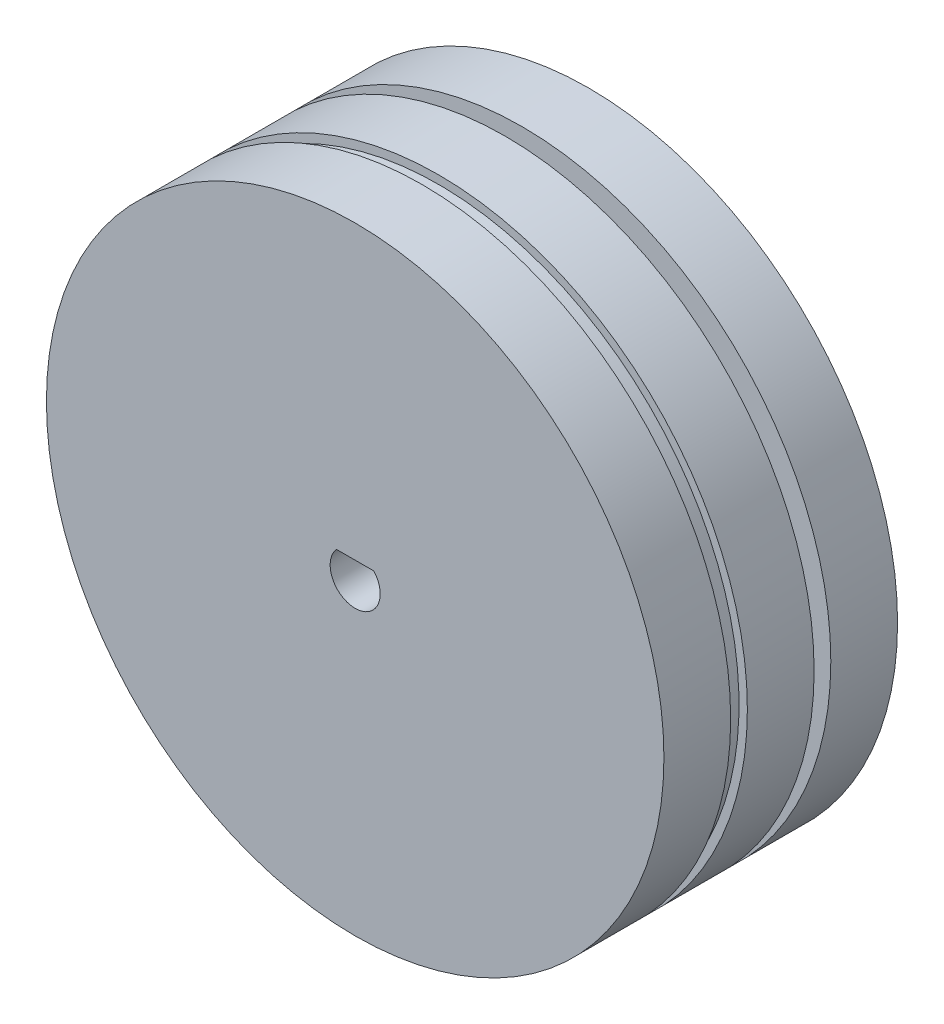
ISO-10303-21;
HEADER;
FILE_DESCRIPTION(('STEP AP214'),'2;1');
FILE_NAME('part.step','',(''),(''),'','','');
FILE_SCHEMA(('AUTOMOTIVE_DESIGN { 1 0 10303 214 1 1 1 1 }'));
ENDSEC;
DATA;
#1=APPLICATION_CONTEXT('core data for automotive mechanical design processes');
#2=APPLICATION_PROTOCOL_DEFINITION('international standard','automotive_design',2000,#1);
#3=PRODUCT_CONTEXT('',#1,'mechanical');
#4=PRODUCT('Part','Part','',(#3));
#5=PRODUCT_RELATED_PRODUCT_CATEGORY('part','',(#4));
#6=PRODUCT_DEFINITION_FORMATION('','',#4);
#7=PRODUCT_DEFINITION_CONTEXT('part definition',#1,'design');
#8=PRODUCT_DEFINITION('design','',#6,#7);
#9=PRODUCT_DEFINITION_SHAPE('','',#8);
#10=(LENGTH_UNIT() NAMED_UNIT(*) SI_UNIT(.MILLI.,.METRE.));
#11=(NAMED_UNIT(*) PLANE_ANGLE_UNIT() SI_UNIT($,.RADIAN.));
#12=(NAMED_UNIT(*) SI_UNIT($,.STERADIAN.) SOLID_ANGLE_UNIT());
#13=UNCERTAINTY_MEASURE_WITH_UNIT(LENGTH_MEASURE(1.E-05),#10,'distance_accuracy_value','');
#14=(GEOMETRIC_REPRESENTATION_CONTEXT(3) GLOBAL_UNCERTAINTY_ASSIGNED_CONTEXT((#13)) GLOBAL_UNIT_ASSIGNED_CONTEXT((#10,
#11,#12)) REPRESENTATION_CONTEXT('',''));
#15=CARTESIAN_POINT('',(0.,0.,0.));
#16=DIRECTION('',(0.,0.,1.));
#17=DIRECTION('',(1.,0.,0.));
#18=AXIS2_PLACEMENT_3D('',#15,#16,#17);
#19=CARTESIAN_POINT('',(0.,0.,4.));
#20=DIRECTION('',(0.,0.,-1.));
#21=DIRECTION('',(-1.,0.,0.));
#22=AXIS2_PLACEMENT_3D('',#19,#20,#21);
#23=CYLINDRICAL_SURFACE('',#22,18.5);
#24=CARTESIAN_POINT('',(0.,0.,4.));
#25=DIRECTION('',(0.,0.,1.));
#26=DIRECTION('',(1.,0.,0.));
#27=AXIS2_PLACEMENT_3D('',#24,#25,#26);
#28=CIRCLE('',#27,18.5);
#29=CARTESIAN_POINT('',(18.5,0.,4.));
#30=VERTEX_POINT('',#29);
#31=EDGE_CURVE('E107',#30,#30,#28,.T.);
#32=ORIENTED_EDGE('',*,*,#31,.F.);
#33=EDGE_LOOP('',(#32));
#34=FACE_BOUND('',#33,.T.);
#35=CARTESIAN_POINT('',(0.,0.,0.));
#36=DIRECTION('',(0.,0.,1.));
#37=DIRECTION('',(1.,0.,0.));
#38=AXIS2_PLACEMENT_3D('',#35,#36,#37);
#39=CIRCLE('',#38,18.5);
#40=CARTESIAN_POINT('',(18.5,0.,0.));
#41=VERTEX_POINT('',#40);
#42=EDGE_CURVE('E40',#41,#41,#39,.T.);
#43=ORIENTED_EDGE('',*,*,#42,.T.);
#44=EDGE_LOOP('',(#43));
#45=FACE_BOUND('',#44,.T.);
#46=ADVANCED_FACE('F37',(#34,#45),#23,.T.);
#47=CARTESIAN_POINT('',(0.,0.,4.));
#48=DIRECTION('',(0.,0.,1.));
#49=DIRECTION('',(1.,0.,0.));
#50=AXIS2_PLACEMENT_3D('',#47,#48,#49);
#51=PLANE('',#50);
#52=CARTESIAN_POINT('',(0.,0.,4.));
#53=DIRECTION('',(0.,0.,1.));
#54=DIRECTION('',(1.,0.,0.));
#55=AXIS2_PLACEMENT_3D('',#52,#53,#54);
#56=CIRCLE('',#55,1.5);
#57=CARTESIAN_POINT('',(-1.1180339887499,1.,4.));
#58=VERTEX_POINT('',#57);
#59=CARTESIAN_POINT('',(1.1180339887499,1.,4.));
#60=VERTEX_POINT('',#59);
#61=EDGE_CURVE('E53',#58,#60,#56,.T.);
#62=ORIENTED_EDGE('',*,*,#61,.F.);
#63=DIRECTION('',(-1.,0.,0.));
#64=VECTOR('',#63,1.);
#65=CARTESIAN_POINT('',(1.1180339887499,1.,4.));
#66=LINE('',#65,#64);
#67=EDGE_CURVE('E73',#60,#58,#66,.T.);
#68=ORIENTED_EDGE('',*,*,#67,.F.);
#69=EDGE_LOOP('',(#62,#68));
#70=FACE_BOUND('',#69,.T.);
#71=ORIENTED_EDGE('',*,*,#31,.T.);
#72=EDGE_LOOP('',(#71));
#73=FACE_BOUND('',#72,.T.);
#74=ADVANCED_FACE('F77',(#70,#73),#51,.T.);
#75=CARTESIAN_POINT('',(0.,0.,0.));
#76=DIRECTION('',(0.,0.,1.));
#77=DIRECTION('',(1.,0.,0.));
#78=AXIS2_PLACEMENT_3D('',#75,#76,#77);
#79=PLANE('',#78);
#80=CARTESIAN_POINT('',(0.,0.,0.));
#81=DIRECTION('',(0.,0.,-1.));
#82=DIRECTION('',(-1.,0.,0.));
#83=AXIS2_PLACEMENT_3D('',#80,#81,#82);
#84=CIRCLE('',#83,18.);
#85=CARTESIAN_POINT('',(-18.,0.,0.));
#86=VERTEX_POINT('',#85);
#87=EDGE_CURVE('E45',#86,#86,#84,.T.);
#88=ORIENTED_EDGE('',*,*,#87,.F.);
#89=EDGE_LOOP('',(#88));
#90=FACE_BOUND('',#89,.T.);
#91=ORIENTED_EDGE('',*,*,#42,.F.);
#92=EDGE_LOOP('',(#91));
#93=FACE_BOUND('',#92,.T.);
#94=ADVANCED_FACE('F114',(#90,#93),#79,.F.);
#95=CARTESIAN_POINT('',(0.,0.,-1.));
#96=DIRECTION('',(0.,0.,1.));
#97=DIRECTION('',(1.,0.,0.));
#98=AXIS2_PLACEMENT_3D('',#95,#96,#97);
#99=CYLINDRICAL_SURFACE('',#98,18.);
#100=CARTESIAN_POINT('',(0.,0.,-1.));
#101=DIRECTION('',(0.,0.,-1.));
#102=DIRECTION('',(-1.,0.,0.));
#103=AXIS2_PLACEMENT_3D('',#100,#101,#102);
#104=CIRCLE('',#103,18.);
#105=CARTESIAN_POINT('',(-18.,0.,-1.));
#106=VERTEX_POINT('',#105);
#107=EDGE_CURVE('E101',#106,#106,#104,.T.);
#108=ORIENTED_EDGE('',*,*,#107,.F.);
#109=EDGE_LOOP('',(#108));
#110=FACE_BOUND('',#109,.T.);
#111=ORIENTED_EDGE('',*,*,#87,.T.);
#112=EDGE_LOOP('',(#111));
#113=FACE_BOUND('',#112,.T.);
#114=ADVANCED_FACE('F116',(#110,#113),#99,.T.);
#115=CARTESIAN_POINT('',(0.,0.,-5.));
#116=DIRECTION('',(0.,0.,1.));
#117=DIRECTION('',(1.,0.,0.));
#118=AXIS2_PLACEMENT_3D('',#115,#116,#117);
#119=CYLINDRICAL_SURFACE('',#118,18.5);
#120=CARTESIAN_POINT('',(0.,0.,-5.));
#121=DIRECTION('',(0.,0.,-1.));
#122=DIRECTION('',(-1.,0.,0.));
#123=AXIS2_PLACEMENT_3D('',#120,#121,#122);
#124=CIRCLE('',#123,18.5);
#125=CARTESIAN_POINT('',(-18.5,0.,-5.));
#126=VERTEX_POINT('',#125);
#127=EDGE_CURVE('E98',#126,#126,#124,.T.);
#128=ORIENTED_EDGE('',*,*,#127,.F.);
#129=EDGE_LOOP('',(#128));
#130=FACE_BOUND('',#129,.T.);
#131=CARTESIAN_POINT('',(0.,0.,-1.));
#132=DIRECTION('',(0.,0.,-1.));
#133=DIRECTION('',(-1.,0.,0.));
#134=AXIS2_PLACEMENT_3D('',#131,#132,#133);
#135=CIRCLE('',#134,18.5);
#136=CARTESIAN_POINT('',(-18.5,0.,-1.));
#137=VERTEX_POINT('',#136);
#138=EDGE_CURVE('E96',#137,#137,#135,.T.);
#139=ORIENTED_EDGE('',*,*,#138,.T.);
#140=EDGE_LOOP('',(#139));
#141=FACE_BOUND('',#140,.T.);
#142=ADVANCED_FACE('F122',(#130,#141),#119,.T.);
#143=CARTESIAN_POINT('',(0.,0.,-5.));
#144=DIRECTION('',(0.,0.,-1.));
#145=DIRECTION('',(-1.,0.,0.));
#146=AXIS2_PLACEMENT_3D('',#143,#144,#145);
#147=PLANE('',#146);
#148=CARTESIAN_POINT('',(0.,0.,-5.));
#149=DIRECTION('',(0.,0.,-1.));
#150=DIRECTION('',(-1.,0.,0.));
#151=AXIS2_PLACEMENT_3D('',#148,#149,#150);
#152=CIRCLE('',#151,17.);
#153=CARTESIAN_POINT('',(-17.,0.,-5.));
#154=VERTEX_POINT('',#153);
#155=EDGE_CURVE('E11',#154,#154,#152,.T.);
#156=ORIENTED_EDGE('',*,*,#155,.F.);
#157=EDGE_LOOP('',(#156));
#158=FACE_BOUND('',#157,.T.);
#159=ORIENTED_EDGE('',*,*,#127,.T.);
#160=EDGE_LOOP('',(#159));
#161=FACE_BOUND('',#160,.T.);
#162=ADVANCED_FACE('F215',(#158,#161),#147,.T.);
#163=CARTESIAN_POINT('',(0.,0.,-1.));
#164=DIRECTION('',(0.,0.,-1.));
#165=DIRECTION('',(-1.,0.,0.));
#166=AXIS2_PLACEMENT_3D('',#163,#164,#165);
#167=PLANE('',#166);
#168=ORIENTED_EDGE('',*,*,#107,.T.);
#169=EDGE_LOOP('',(#168));
#170=FACE_BOUND('',#169,.T.);
#171=ORIENTED_EDGE('',*,*,#138,.F.);
#172=EDGE_LOOP('',(#171));
#173=FACE_BOUND('',#172,.T.);
#174=ADVANCED_FACE('F213',(#170,#173),#167,.F.);
#175=CARTESIAN_POINT('',(0.,0.,-6.));
#176=DIRECTION('',(0.,0.,1.));
#177=DIRECTION('',(1.,0.,0.));
#178=AXIS2_PLACEMENT_3D('',#175,#176,#177);
#179=CYLINDRICAL_SURFACE('',#178,17.);
#180=CARTESIAN_POINT('',(0.,0.,-6.));
#181=DIRECTION('',(0.,0.,-1.));
#182=DIRECTION('',(-1.,0.,0.));
#183=AXIS2_PLACEMENT_3D('',#180,#181,#182);
#184=CIRCLE('',#183,17.);
#185=CARTESIAN_POINT('',(-17.,0.,-6.));
#186=VERTEX_POINT('',#185);
#187=EDGE_CURVE('E92',#186,#186,#184,.T.);
#188=ORIENTED_EDGE('',*,*,#187,.F.);
#189=EDGE_LOOP('',(#188));
#190=FACE_BOUND('',#189,.T.);
#191=ORIENTED_EDGE('',*,*,#155,.T.);
#192=EDGE_LOOP('',(#191));
#193=FACE_BOUND('',#192,.T.);
#194=ADVANCED_FACE('F209',(#190,#193),#179,.T.);
#195=CARTESIAN_POINT('',(0.,0.,-10.));
#196=DIRECTION('',(0.,0.,1.));
#197=DIRECTION('',(1.,0.,0.));
#198=AXIS2_PLACEMENT_3D('',#195,#196,#197);
#199=CYLINDRICAL_SURFACE('',#198,18.5);
#200=CARTESIAN_POINT('',(0.,0.,-10.));
#201=DIRECTION('',(0.,0.,-1.));
#202=DIRECTION('',(-1.,0.,0.));
#203=AXIS2_PLACEMENT_3D('',#200,#201,#202);
#204=CIRCLE('',#203,18.5);
#205=CARTESIAN_POINT('',(-18.5,0.,-10.));
#206=VERTEX_POINT('',#205);
#207=EDGE_CURVE('E89',#206,#206,#204,.T.);
#208=ORIENTED_EDGE('',*,*,#207,.F.);
#209=EDGE_LOOP('',(#208));
#210=FACE_BOUND('',#209,.T.);
#211=CARTESIAN_POINT('',(0.,0.,-6.));
#212=DIRECTION('',(0.,0.,-1.));
#213=DIRECTION('',(-1.,0.,0.));
#214=AXIS2_PLACEMENT_3D('',#211,#212,#213);
#215=CIRCLE('',#214,18.5);
#216=CARTESIAN_POINT('',(-18.5,0.,-6.));
#217=VERTEX_POINT('',#216);
#218=EDGE_CURVE('E69',#217,#217,#215,.T.);
#219=ORIENTED_EDGE('',*,*,#218,.T.);
#220=EDGE_LOOP('',(#219));
#221=FACE_BOUND('',#220,.T.);
#222=ADVANCED_FACE('F181',(#210,#221),#199,.T.);
#223=CARTESIAN_POINT('',(0.,0.,-10.));
#224=DIRECTION('',(0.,0.,-1.));
#225=DIRECTION('',(-1.,0.,0.));
#226=AXIS2_PLACEMENT_3D('',#223,#224,#225);
#227=PLANE('',#226);
#228=CARTESIAN_POINT('',(0.,0.,-10.));
#229=DIRECTION('',(0.,0.,-1.));
#230=DIRECTION('',(-1.,0.,0.));
#231=AXIS2_PLACEMENT_3D('',#228,#229,#230);
#232=CIRCLE('',#231,3.);
#233=CARTESIAN_POINT('',(-3.,0.,-10.));
#234=VERTEX_POINT('',#233);
#235=EDGE_CURVE('E82',#234,#234,#232,.T.);
#236=ORIENTED_EDGE('',*,*,#235,.F.);
#237=EDGE_LOOP('',(#236));
#238=FACE_BOUND('',#237,.T.);
#239=ORIENTED_EDGE('',*,*,#207,.T.);
#240=EDGE_LOOP('',(#239));
#241=FACE_BOUND('',#240,.T.);
#242=ADVANCED_FACE('F176',(#238,#241),#227,.T.);
#243=CARTESIAN_POINT('',(0.,0.,-6.));
#244=DIRECTION('',(0.,0.,-1.));
#245=DIRECTION('',(-1.,0.,0.));
#246=AXIS2_PLACEMENT_3D('',#243,#244,#245);
#247=PLANE('',#246);
#248=ORIENTED_EDGE('',*,*,#187,.T.);
#249=EDGE_LOOP('',(#248));
#250=FACE_BOUND('',#249,.T.);
#251=ORIENTED_EDGE('',*,*,#218,.F.);
#252=EDGE_LOOP('',(#251));
#253=FACE_BOUND('',#252,.T.);
#254=ADVANCED_FACE('F142',(#250,#253),#247,.F.);
#255=CARTESIAN_POINT('',(0.,0.,-2.));
#256=DIRECTION('',(0.,0.,1.));
#257=DIRECTION('',(1.,0.,0.));
#258=AXIS2_PLACEMENT_3D('',#255,#256,#257);
#259=CYLINDRICAL_SURFACE('',#258,1.5);
#260=ORIENTED_EDGE('',*,*,#61,.T.);
#261=DIRECTION('',(0.,0.,1.));
#262=VECTOR('',#261,1.);
#263=CARTESIAN_POINT('',(1.1180339887499,1.,-2.));
#264=LINE('',#263,#262);
#265=CARTESIAN_POINT('',(1.1180339887499,1.,-2.));
#266=VERTEX_POINT('',#265);
#267=EDGE_CURVE('E70',#266,#60,#264,.T.);
#268=ORIENTED_EDGE('',*,*,#267,.F.);
#269=CARTESIAN_POINT('',(0.,0.,-2.));
#270=DIRECTION('',(0.,0.,1.));
#271=DIRECTION('',(1.,0.,0.));
#272=AXIS2_PLACEMENT_3D('',#269,#270,#271);
#273=CIRCLE('',#272,1.5);
#274=CARTESIAN_POINT('',(-1.1180339887499,1.,-2.));
#275=VERTEX_POINT('',#274);
#276=EDGE_CURVE('E67',#275,#266,#273,.T.);
#277=ORIENTED_EDGE('',*,*,#276,.F.);
#278=DIRECTION('',(0.,0.,1.));
#279=VECTOR('',#278,1.);
#280=CARTESIAN_POINT('',(-1.1180339887499,1.,-2.));
#281=LINE('',#280,#279);
#282=EDGE_CURVE('E61',#275,#58,#281,.T.);
#283=ORIENTED_EDGE('',*,*,#282,.T.);
#284=EDGE_LOOP('',(#260,#268,#277,#283));
#285=FACE_BOUND('',#284,.T.);
#286=ADVANCED_FACE('F65',(#285),#259,.F.);
#287=CARTESIAN_POINT('',(1.1180339887499,1.,-2.));
#288=DIRECTION('',(0.,1.,0.));
#289=DIRECTION('',(0.,0.,1.));
#290=AXIS2_PLACEMENT_3D('',#287,#288,#289);
#291=PLANE('',#290);
#292=ORIENTED_EDGE('',*,*,#67,.T.);
#293=ORIENTED_EDGE('',*,*,#282,.F.);
#294=DIRECTION('',(-1.,0.,0.));
#295=VECTOR('',#294,1.);
#296=CARTESIAN_POINT('',(1.1180339887499,1.,-2.));
#297=LINE('',#296,#295);
#298=EDGE_CURVE('E85',#266,#275,#297,.T.);
#299=ORIENTED_EDGE('',*,*,#298,.F.);
#300=ORIENTED_EDGE('',*,*,#267,.T.);
#301=EDGE_LOOP('',(#292,#293,#299,#300));
#302=FACE_BOUND('',#301,.T.);
#303=ADVANCED_FACE('F74',(#302),#291,.F.);
#304=CARTESIAN_POINT('',(0.,0.,-2.));
#305=DIRECTION('',(0.,0.,1.));
#306=DIRECTION('',(1.,0.,0.));
#307=AXIS2_PLACEMENT_3D('',#304,#305,#306);
#308=PLANE('',#307);
#309=ORIENTED_EDGE('',*,*,#276,.T.);
#310=ORIENTED_EDGE('',*,*,#298,.T.);
#311=EDGE_LOOP('',(#309,#310));
#312=FACE_BOUND('',#311,.T.);
#313=ADVANCED_FACE('F159',(#312),#308,.T.);
#314=CARTESIAN_POINT('',(0.,0.,-7.5));
#315=DIRECTION('',(0.,0.,-1.));
#316=DIRECTION('',(-1.,0.,0.));
#317=AXIS2_PLACEMENT_3D('',#314,#315,#316);
#318=CYLINDRICAL_SURFACE('',#317,3.);
#319=CARTESIAN_POINT('',(0.,0.,-7.5));
#320=DIRECTION('',(0.,0.,-1.));
#321=DIRECTION('',(-1.,0.,0.));
#322=AXIS2_PLACEMENT_3D('',#319,#320,#321);
#323=CIRCLE('',#322,3.);
#324=CARTESIAN_POINT('',(-3.,0.,-7.5));
#325=VERTEX_POINT('',#324);
#326=EDGE_CURVE('E79',#325,#325,#323,.T.);
#327=ORIENTED_EDGE('',*,*,#326,.F.);
#328=EDGE_LOOP('',(#327));
#329=FACE_BOUND('',#328,.T.);
#330=ORIENTED_EDGE('',*,*,#235,.T.);
#331=EDGE_LOOP('',(#330));
#332=FACE_BOUND('',#331,.T.);
#333=ADVANCED_FACE('F168',(#329,#332),#318,.F.);
#334=CARTESIAN_POINT('',(0.,0.,-7.5));
#335=DIRECTION('',(0.,0.,-1.));
#336=DIRECTION('',(-1.,0.,0.));
#337=AXIS2_PLACEMENT_3D('',#334,#335,#336);
#338=PLANE('',#337);
#339=ORIENTED_EDGE('',*,*,#326,.T.);
#340=EDGE_LOOP('',(#339));
#341=FACE_BOUND('',#340,.T.);
#342=ADVANCED_FACE('F191',(#341),#338,.T.);
#343=CLOSED_SHELL('',(#46,#74,#94,#114,#142,#162,#174,#194,#222,#242,#254,#286,#303,#313,#333,#342));
#344=MANIFOLD_SOLID_BREP('B2',#343);
#345=ADVANCED_BREP_SHAPE_REPRESENTATION('',(#18,#344),#14);
#346=SHAPE_DEFINITION_REPRESENTATION(#9,#345);
ENDSEC;
END-ISO-10303-21;
